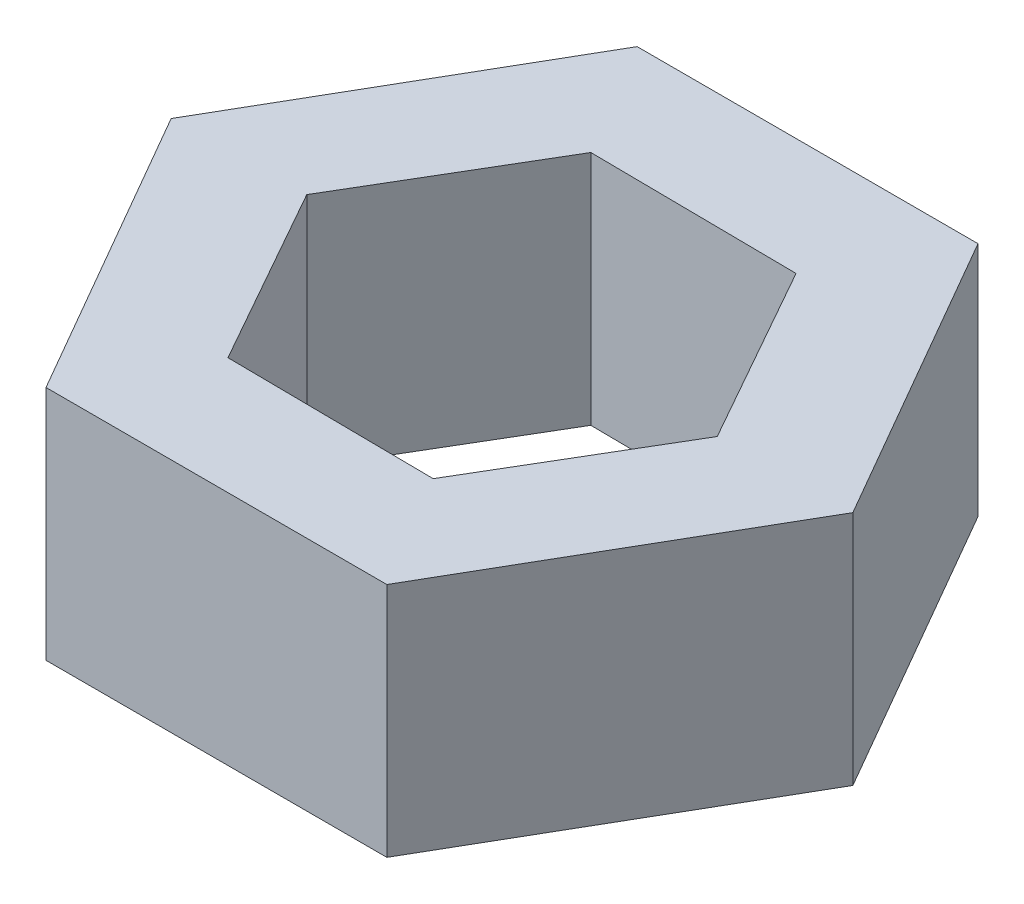
ISO-10303-21;
HEADER;
FILE_DESCRIPTION(('STEP AP214'),'2;1');
FILE_NAME('part.step','',(''),(''),'','','');
FILE_SCHEMA(('AUTOMOTIVE_DESIGN { 1 0 10303 214 1 1 1 1 }'));
ENDSEC;
DATA;
#1=APPLICATION_CONTEXT('core data for automotive mechanical design processes');
#2=APPLICATION_PROTOCOL_DEFINITION('international standard','automotive_design',2000,#1);
#3=PRODUCT_CONTEXT('',#1,'mechanical');
#4=PRODUCT('Part','Part','',(#3));
#5=PRODUCT_RELATED_PRODUCT_CATEGORY('part','',(#4));
#6=PRODUCT_DEFINITION_FORMATION('','',#4);
#7=PRODUCT_DEFINITION_CONTEXT('part definition',#1,'design');
#8=PRODUCT_DEFINITION('design','',#6,#7);
#9=PRODUCT_DEFINITION_SHAPE('','',#8);
#10=(LENGTH_UNIT() NAMED_UNIT(*) SI_UNIT(.MILLI.,.METRE.));
#11=(NAMED_UNIT(*) PLANE_ANGLE_UNIT() SI_UNIT($,.RADIAN.));
#12=(NAMED_UNIT(*) SI_UNIT($,.STERADIAN.) SOLID_ANGLE_UNIT());
#13=UNCERTAINTY_MEASURE_WITH_UNIT(LENGTH_MEASURE(1.E-05),#10,'distance_accuracy_value','');
#14=(GEOMETRIC_REPRESENTATION_CONTEXT(3) GLOBAL_UNCERTAINTY_ASSIGNED_CONTEXT((#13)) GLOBAL_UNIT_ASSIGNED_CONTEXT((#10,
#11,#12)) REPRESENTATION_CONTEXT('',''));
#15=CARTESIAN_POINT('',(0.,0.,0.));
#16=DIRECTION('',(0.,0.,1.));
#17=DIRECTION('',(1.,0.,0.));
#18=AXIS2_PLACEMENT_3D('',#15,#16,#17);
#19=CARTESIAN_POINT('',(0.,5.,0.));
#20=DIRECTION('',(0.,1.,0.));
#21=DIRECTION('',(0.,0.,1.));
#22=AXIS2_PLACEMENT_3D('',#19,#20,#21);
#23=PLANE('',#22);
#24=DIRECTION('',(0.99999978219207,0.,0.000660011979197733));
#25=VECTOR('',#24,1.);
#26=CARTESIAN_POINT('',(-3.61256347135848,5.,6.24761702561382));
#27=LINE('',#26,#25);
#28=CARTESIAN_POINT('',(-3.61256347135848,5.,6.24761702561382));
#29=VERTEX_POINT('',#28);
#30=CARTESIAN_POINT('',(3.60431332161851,5.,6.25238025178705));
#31=VERTEX_POINT('',#30);
#32=EDGE_CURVE('E173',#29,#31,#27,.T.);
#33=ORIENTED_EDGE('',*,*,#32,.T.);
#34=DIRECTION('',(0.500571478236822,0.,-0.865695209167639));
#35=VECTOR('',#34,1.);
#36=CARTESIAN_POINT('',(3.60431332161851,5.,6.25238025178705));
#37=LINE('',#36,#35);
#38=CARTESIAN_POINT('',(7.21687679297698,5.,0.00476322617322478));
#39=VERTEX_POINT('',#38);
#40=EDGE_CURVE('E176',#31,#39,#37,.T.);
#41=ORIENTED_EDGE('',*,*,#40,.T.);
#42=DIRECTION('',(-0.499428303955248,0.,-0.866355221146837));
#43=VECTOR('',#42,1.);
#44=CARTESIAN_POINT('',(7.21687679297698,5.,0.00476322617322478));
#45=LINE('',#44,#43);
#46=CARTESIAN_POINT('',(3.61256347135847,5.,-6.24761702561383));
#47=VERTEX_POINT('',#46);
#48=EDGE_CURVE('E179',#39,#47,#45,.T.);
#49=ORIENTED_EDGE('',*,*,#48,.T.);
#50=DIRECTION('',(-0.99999978219207,0.,-0.000660011979197492));
#51=VECTOR('',#50,1.);
#52=CARTESIAN_POINT('',(3.61256347135847,5.,-6.24761702561383));
#53=LINE('',#52,#51);
#54=CARTESIAN_POINT('',(-3.60431332161851,5.,-6.25238025178705));
#55=VERTEX_POINT('',#54);
#56=EDGE_CURVE('E181',#47,#55,#53,.T.);
#57=ORIENTED_EDGE('',*,*,#56,.T.);
#58=DIRECTION('',(-0.500571478236822,0.,0.865695209167639));
#59=VECTOR('',#58,1.);
#60=CARTESIAN_POINT('',(-3.60431332161851,5.,-6.25238025178705));
#61=LINE('',#60,#59);
#62=CARTESIAN_POINT('',(-7.21687679297698,5.,-0.00476322617322694));
#63=VERTEX_POINT('',#62);
#64=EDGE_CURVE('E183',#55,#63,#61,.T.);
#65=ORIENTED_EDGE('',*,*,#64,.T.);
#66=DIRECTION('',(0.499428303955248,0.,0.866355221146837));
#67=VECTOR('',#66,1.);
#68=CARTESIAN_POINT('',(-7.21687679297698,5.,-0.00476322617322694));
#69=LINE('',#68,#67);
#70=EDGE_CURVE('E185',#63,#29,#69,.T.);
#71=ORIENTED_EDGE('',*,*,#70,.T.);
#72=EDGE_LOOP('',(#33,#41,#49,#57,#65,#71));
#73=FACE_BOUND('',#72,.T.);
#74=DIRECTION('',(0.508933412048692,0.,-0.860805891069802));
#75=VECTOR('',#74,1.);
#76=CARTESIAN_POINT('',(2.1544975847708,5.,3.82249571491586));
#77=LINE('',#76,#75);
#78=CARTESIAN_POINT('',(2.1544975847708,5.,3.82249571491586));
#79=VERTEX_POINT('',#78);
#80=CARTESIAN_POINT('',(4.3876271873597,5.,0.0453982166541963));
#81=VERTEX_POINT('',#80);
#82=EDGE_CURVE('E130',#79,#81,#77,.T.);
#83=ORIENTED_EDGE('',*,*,#82,.F.);
#84=DIRECTION('',(0.999946475418095,0.,0.0103463181339593));
#85=VECTOR('',#84,1.);
#86=CARTESIAN_POINT('',(-2.23312960258889,5.,3.77709749826166));
#87=LINE('',#86,#85);
#88=CARTESIAN_POINT('',(-2.23312960258889,5.,3.77709749826166));
#89=VERTEX_POINT('',#88);
#90=EDGE_CURVE('E122',#89,#79,#87,.T.);
#91=ORIENTED_EDGE('',*,*,#90,.F.);
#92=DIRECTION('',(0.491013063369403,0.,0.871152209203762));
#93=VECTOR('',#92,1.);
#94=CARTESIAN_POINT('',(-4.3876271873597,5.,-0.0453982166541961));
#95=LINE('',#94,#93);
#96=CARTESIAN_POINT('',(-4.3876271873597,5.,-0.0453982166541964));
#97=VERTEX_POINT('',#96);
#98=EDGE_CURVE('E151',#97,#89,#95,.T.);
#99=ORIENTED_EDGE('',*,*,#98,.F.);
#100=DIRECTION('',(-0.508933412048692,0.,0.860805891069802));
#101=VECTOR('',#100,1.);
#102=CARTESIAN_POINT('',(-2.1544975847708,5.,-3.82249571491586));
#103=LINE('',#102,#101);
#104=CARTESIAN_POINT('',(-2.1544975847708,5.,-3.82249571491586));
#105=VERTEX_POINT('',#104);
#106=EDGE_CURVE('E149',#105,#97,#103,.T.);
#107=ORIENTED_EDGE('',*,*,#106,.F.);
#108=DIRECTION('',(-0.999946475418095,0.,-0.0103463181339592));
#109=VECTOR('',#108,1.);
#110=CARTESIAN_POINT('',(2.23312960258889,5.,-3.77709749826166));
#111=LINE('',#110,#109);
#112=CARTESIAN_POINT('',(2.23312960258889,5.,-3.77709749826166));
#113=VERTEX_POINT('',#112);
#114=EDGE_CURVE('E145',#113,#105,#111,.T.);
#115=ORIENTED_EDGE('',*,*,#114,.F.);
#116=DIRECTION('',(-0.491013063369403,0.,-0.871152209203762));
#117=VECTOR('',#116,1.);
#118=CARTESIAN_POINT('',(4.3876271873597,5.,0.0453982166541963));
#119=LINE('',#118,#117);
#120=EDGE_CURVE('E143',#81,#113,#119,.T.);
#121=ORIENTED_EDGE('',*,*,#120,.F.);
#122=EDGE_LOOP('',(#83,#91,#99,#107,#115,#121));
#123=FACE_BOUND('',#122,.T.);
#124=ADVANCED_FACE('F33',(#73,#123),#23,.T.);
#125=CARTESIAN_POINT('',(0.,0.,0.));
#126=DIRECTION('',(0.,1.,0.));
#127=DIRECTION('',(0.,0.,1.));
#128=AXIS2_PLACEMENT_3D('',#125,#126,#127);
#129=PLANE('',#128);
#130=DIRECTION('',(0.99999978219207,0.,0.000660011979197733));
#131=VECTOR('',#130,1.);
#132=CARTESIAN_POINT('',(-3.61256347135848,0.,6.24761702561382));
#133=LINE('',#132,#131);
#134=CARTESIAN_POINT('',(-3.61256347135848,0.,6.24761702561382));
#135=VERTEX_POINT('',#134);
#136=CARTESIAN_POINT('',(3.60431332161851,0.,6.25238025178705));
#137=VERTEX_POINT('',#136);
#138=EDGE_CURVE('E138',#135,#137,#133,.T.);
#139=ORIENTED_EDGE('',*,*,#138,.F.);
#140=DIRECTION('',(0.499428303955248,0.,0.866355221146837));
#141=VECTOR('',#140,1.);
#142=CARTESIAN_POINT('',(-7.21687679297698,0.,-0.00476322617322694));
#143=LINE('',#142,#141);
#144=CARTESIAN_POINT('',(-7.21687679297698,0.,-0.00476322617322694));
#145=VERTEX_POINT('',#144);
#146=EDGE_CURVE('E177',#145,#135,#143,.T.);
#147=ORIENTED_EDGE('',*,*,#146,.F.);
#148=DIRECTION('',(-0.500571478236822,0.,0.865695209167639));
#149=VECTOR('',#148,1.);
#150=CARTESIAN_POINT('',(-3.60431332161851,0.,-6.25238025178705));
#151=LINE('',#150,#149);
#152=CARTESIAN_POINT('',(-3.60431332161851,0.,-6.25238025178705));
#153=VERTEX_POINT('',#152);
#154=EDGE_CURVE('E196',#153,#145,#151,.T.);
#155=ORIENTED_EDGE('',*,*,#154,.F.);
#156=DIRECTION('',(-0.99999978219207,0.,-0.000660011979197492));
#157=VECTOR('',#156,1.);
#158=CARTESIAN_POINT('',(3.61256347135847,0.,-6.24761702561383));
#159=LINE('',#158,#157);
#160=CARTESIAN_POINT('',(3.61256347135847,0.,-6.24761702561383));
#161=VERTEX_POINT('',#160);
#162=EDGE_CURVE('E194',#161,#153,#159,.T.);
#163=ORIENTED_EDGE('',*,*,#162,.F.);
#164=DIRECTION('',(-0.499428303955248,0.,-0.866355221146837));
#165=VECTOR('',#164,1.);
#166=CARTESIAN_POINT('',(7.21687679297698,0.,0.00476322617322478));
#167=LINE('',#166,#165);
#168=CARTESIAN_POINT('',(7.21687679297698,0.,0.00476322617322478));
#169=VERTEX_POINT('',#168);
#170=EDGE_CURVE('E192',#169,#161,#167,.T.);
#171=ORIENTED_EDGE('',*,*,#170,.F.);
#172=DIRECTION('',(0.500571478236822,0.,-0.865695209167639));
#173=VECTOR('',#172,1.);
#174=CARTESIAN_POINT('',(3.60431332161851,0.,6.25238025178705));
#175=LINE('',#174,#173);
#176=EDGE_CURVE('E190',#137,#169,#175,.T.);
#177=ORIENTED_EDGE('',*,*,#176,.F.);
#178=EDGE_LOOP('',(#139,#147,#155,#163,#171,#177));
#179=FACE_BOUND('',#178,.T.);
#180=DIRECTION('',(0.999946475418095,0.,0.0103463181339593));
#181=VECTOR('',#180,1.);
#182=CARTESIAN_POINT('',(-2.23312960258889,0.,3.77709749826166));
#183=LINE('',#182,#181);
#184=CARTESIAN_POINT('',(-2.23312960258889,0.,3.77709749826166));
#185=VERTEX_POINT('',#184);
#186=CARTESIAN_POINT('',(2.1544975847708,0.,3.82249571491586));
#187=VERTEX_POINT('',#186);
#188=EDGE_CURVE('E56',#185,#187,#183,.T.);
#189=ORIENTED_EDGE('',*,*,#188,.T.);
#190=DIRECTION('',(0.508933412048692,0.,-0.860805891069802));
#191=VECTOR('',#190,1.);
#192=CARTESIAN_POINT('',(2.1544975847708,0.,3.82249571491586));
#193=LINE('',#192,#191);
#194=CARTESIAN_POINT('',(4.3876271873597,0.,0.0453982166541963));
#195=VERTEX_POINT('',#194);
#196=EDGE_CURVE('E137',#187,#195,#193,.T.);
#197=ORIENTED_EDGE('',*,*,#196,.T.);
#198=DIRECTION('',(-0.491013063369403,0.,-0.871152209203762));
#199=VECTOR('',#198,1.);
#200=CARTESIAN_POINT('',(4.3876271873597,0.,0.0453982166541963));
#201=LINE('',#200,#199);
#202=CARTESIAN_POINT('',(2.23312960258889,0.,-3.77709749826166));
#203=VERTEX_POINT('',#202);
#204=EDGE_CURVE('E155',#195,#203,#201,.T.);
#205=ORIENTED_EDGE('',*,*,#204,.T.);
#206=DIRECTION('',(-0.999946475418095,0.,-0.0103463181339592));
#207=VECTOR('',#206,1.);
#208=CARTESIAN_POINT('',(2.23312960258889,0.,-3.77709749826166));
#209=LINE('',#208,#207);
#210=CARTESIAN_POINT('',(-2.1544975847708,0.,-3.82249571491586));
#211=VERTEX_POINT('',#210);
#212=EDGE_CURVE('E158',#203,#211,#209,.T.);
#213=ORIENTED_EDGE('',*,*,#212,.T.);
#214=DIRECTION('',(-0.508933412048692,0.,0.860805891069802));
#215=VECTOR('',#214,1.);
#216=CARTESIAN_POINT('',(-2.1544975847708,0.,-3.82249571491586));
#217=LINE('',#216,#215);
#218=CARTESIAN_POINT('',(-4.3876271873597,0.,-0.0453982166541961));
#219=VERTEX_POINT('',#218);
#220=EDGE_CURVE('E161',#211,#219,#217,.T.);
#221=ORIENTED_EDGE('',*,*,#220,.T.);
#222=DIRECTION('',(0.491013063369403,0.,0.871152209203762));
#223=VECTOR('',#222,1.);
#224=CARTESIAN_POINT('',(-4.3876271873597,0.,-0.0453982166541961));
#225=LINE('',#224,#223);
#226=EDGE_CURVE('E131',#219,#185,#225,.T.);
#227=ORIENTED_EDGE('',*,*,#226,.T.);
#228=EDGE_LOOP('',(#189,#197,#205,#213,#221,#227));
#229=FACE_BOUND('',#228,.T.);
#230=ADVANCED_FACE('F220',(#179,#229),#129,.F.);
#231=CARTESIAN_POINT('',(-3.61256347135848,5.,6.24761702561382));
#232=DIRECTION('',(0.000660011979197733,0.,-0.99999978219207));
#233=DIRECTION('',(-0.99999978219207,0.,-0.000660011979197733));
#234=AXIS2_PLACEMENT_3D('',#231,#232,#233);
#235=PLANE('',#234);
#236=ORIENTED_EDGE('',*,*,#138,.T.);
#237=DIRECTION('',(0.,-1.,0.));
#238=VECTOR('',#237,1.);
#239=CARTESIAN_POINT('',(3.60431332161851,5.,6.25238025178705));
#240=LINE('',#239,#238);
#241=EDGE_CURVE('E11',#31,#137,#240,.T.);
#242=ORIENTED_EDGE('',*,*,#241,.F.);
#243=ORIENTED_EDGE('',*,*,#32,.F.);
#244=DIRECTION('',(0.,-1.,0.));
#245=VECTOR('',#244,1.);
#246=CARTESIAN_POINT('',(-3.61256347135848,5.,6.24761702561382));
#247=LINE('',#246,#245);
#248=EDGE_CURVE('E187',#29,#135,#247,.T.);
#249=ORIENTED_EDGE('',*,*,#248,.T.);
#250=EDGE_LOOP('',(#236,#242,#243,#249));
#251=FACE_BOUND('',#250,.T.);
#252=ADVANCED_FACE('F35',(#251),#235,.F.);
#253=CARTESIAN_POINT('',(3.60431332161851,5.,6.25238025178705));
#254=DIRECTION('',(-0.865695209167639,0.,-0.500571478236822));
#255=DIRECTION('',(-0.500571478236822,0.,0.865695209167639));
#256=AXIS2_PLACEMENT_3D('',#253,#254,#255);
#257=PLANE('',#256);
#258=ORIENTED_EDGE('',*,*,#176,.T.);
#259=DIRECTION('',(0.,-1.,0.));
#260=VECTOR('',#259,1.);
#261=CARTESIAN_POINT('',(7.21687679297698,5.,0.00476322617322478));
#262=LINE('',#261,#260);
#263=EDGE_CURVE('E41',#39,#169,#262,.T.);
#264=ORIENTED_EDGE('',*,*,#263,.F.);
#265=ORIENTED_EDGE('',*,*,#40,.F.);
#266=ORIENTED_EDGE('',*,*,#241,.T.);
#267=EDGE_LOOP('',(#258,#264,#265,#266));
#268=FACE_BOUND('',#267,.T.);
#269=ADVANCED_FACE('F237',(#268),#257,.F.);
#270=CARTESIAN_POINT('',(7.21687679297698,5.,0.00476322617322478));
#271=DIRECTION('',(-0.866355221146837,0.,0.499428303955248));
#272=DIRECTION('',(0.499428303955248,0.,0.866355221146837));
#273=AXIS2_PLACEMENT_3D('',#270,#271,#272);
#274=PLANE('',#273);
#275=ORIENTED_EDGE('',*,*,#170,.T.);
#276=DIRECTION('',(0.,-1.,0.));
#277=VECTOR('',#276,1.);
#278=CARTESIAN_POINT('',(3.61256347135847,5.,-6.24761702561383));
#279=LINE('',#278,#277);
#280=EDGE_CURVE('E207',#47,#161,#279,.T.);
#281=ORIENTED_EDGE('',*,*,#280,.F.);
#282=ORIENTED_EDGE('',*,*,#48,.F.);
#283=ORIENTED_EDGE('',*,*,#263,.T.);
#284=EDGE_LOOP('',(#275,#281,#282,#283));
#285=FACE_BOUND('',#284,.T.);
#286=ADVANCED_FACE('F214',(#285),#274,.F.);
#287=CARTESIAN_POINT('',(3.61256347135847,5.,-6.24761702561383));
#288=DIRECTION('',(-0.000660011979197492,0.,0.99999978219207));
#289=DIRECTION('',(0.99999978219207,0.,0.000660011979197492));
#290=AXIS2_PLACEMENT_3D('',#287,#288,#289);
#291=PLANE('',#290);
#292=ORIENTED_EDGE('',*,*,#162,.T.);
#293=DIRECTION('',(0.,-1.,0.));
#294=VECTOR('',#293,1.);
#295=CARTESIAN_POINT('',(-3.60431332161851,5.,-6.25238025178705));
#296=LINE('',#295,#294);
#297=EDGE_CURVE('E204',#55,#153,#296,.T.);
#298=ORIENTED_EDGE('',*,*,#297,.F.);
#299=ORIENTED_EDGE('',*,*,#56,.F.);
#300=ORIENTED_EDGE('',*,*,#280,.T.);
#301=EDGE_LOOP('',(#292,#298,#299,#300));
#302=FACE_BOUND('',#301,.T.);
#303=ADVANCED_FACE('F226',(#302),#291,.F.);
#304=CARTESIAN_POINT('',(-3.60431332161851,5.,-6.25238025178705));
#305=DIRECTION('',(0.865695209167639,0.,0.500571478236822));
#306=DIRECTION('',(0.500571478236822,0.,-0.865695209167639));
#307=AXIS2_PLACEMENT_3D('',#304,#305,#306);
#308=PLANE('',#307);
#309=ORIENTED_EDGE('',*,*,#154,.T.);
#310=DIRECTION('',(0.,-1.,0.));
#311=VECTOR('',#310,1.);
#312=CARTESIAN_POINT('',(-7.21687679297698,5.,-0.00476322617322694));
#313=LINE('',#312,#311);
#314=EDGE_CURVE('E201',#63,#145,#313,.T.);
#315=ORIENTED_EDGE('',*,*,#314,.F.);
#316=ORIENTED_EDGE('',*,*,#64,.F.);
#317=ORIENTED_EDGE('',*,*,#297,.T.);
#318=EDGE_LOOP('',(#309,#315,#316,#317));
#319=FACE_BOUND('',#318,.T.);
#320=ADVANCED_FACE('F230',(#319),#308,.F.);
#321=CARTESIAN_POINT('',(-7.21687679297698,5.,-0.00476322617322694));
#322=DIRECTION('',(0.866355221146837,0.,-0.499428303955248));
#323=DIRECTION('',(-0.499428303955248,0.,-0.866355221146837));
#324=AXIS2_PLACEMENT_3D('',#321,#322,#323);
#325=PLANE('',#324);
#326=ORIENTED_EDGE('',*,*,#146,.T.);
#327=ORIENTED_EDGE('',*,*,#248,.F.);
#328=ORIENTED_EDGE('',*,*,#70,.F.);
#329=ORIENTED_EDGE('',*,*,#314,.T.);
#330=EDGE_LOOP('',(#326,#327,#328,#329));
#331=FACE_BOUND('',#330,.T.);
#332=ADVANCED_FACE('F240',(#331),#325,.F.);
#333=CARTESIAN_POINT('',(-2.23312960258889,5.,3.77709749826166));
#334=DIRECTION('',(0.0103463181339593,0.,-0.999946475418095));
#335=DIRECTION('',(-0.999946475418095,0.,-0.0103463181339593));
#336=AXIS2_PLACEMENT_3D('',#333,#334,#335);
#337=PLANE('',#336);
#338=ORIENTED_EDGE('',*,*,#188,.F.);
#339=DIRECTION('',(0.,-1.,0.));
#340=VECTOR('',#339,1.);
#341=CARTESIAN_POINT('',(-2.23312960258889,5.,3.77709749826166));
#342=LINE('',#341,#340);
#343=EDGE_CURVE('E126',#89,#185,#342,.T.);
#344=ORIENTED_EDGE('',*,*,#343,.F.);
#345=ORIENTED_EDGE('',*,*,#90,.T.);
#346=DIRECTION('',(0.,-1.,0.));
#347=VECTOR('',#346,1.);
#348=CARTESIAN_POINT('',(2.1544975847708,5.,3.82249571491586));
#349=LINE('',#348,#347);
#350=EDGE_CURVE('E125',#79,#187,#349,.T.);
#351=ORIENTED_EDGE('',*,*,#350,.T.);
#352=EDGE_LOOP('',(#338,#344,#345,#351));
#353=FACE_BOUND('',#352,.T.);
#354=ADVANCED_FACE('F124',(#353),#337,.T.);
#355=CARTESIAN_POINT('',(2.1544975847708,5.,3.82249571491586));
#356=DIRECTION('',(-0.860805891069802,0.,-0.508933412048692));
#357=DIRECTION('',(-0.508933412048692,0.,0.860805891069802));
#358=AXIS2_PLACEMENT_3D('',#355,#356,#357);
#359=PLANE('',#358);
#360=ORIENTED_EDGE('',*,*,#196,.F.);
#361=ORIENTED_EDGE('',*,*,#350,.F.);
#362=ORIENTED_EDGE('',*,*,#82,.T.);
#363=DIRECTION('',(0.,-1.,0.));
#364=VECTOR('',#363,1.);
#365=CARTESIAN_POINT('',(4.3876271873597,5.,0.0453982166541963));
#366=LINE('',#365,#364);
#367=EDGE_CURVE('E139',#81,#195,#366,.T.);
#368=ORIENTED_EDGE('',*,*,#367,.T.);
#369=EDGE_LOOP('',(#360,#361,#362,#368));
#370=FACE_BOUND('',#369,.T.);
#371=ADVANCED_FACE('F134',(#370),#359,.T.);
#372=CARTESIAN_POINT('',(4.3876271873597,5.,0.0453982166541963));
#373=DIRECTION('',(-0.871152209203762,0.,0.491013063369403));
#374=DIRECTION('',(0.491013063369403,0.,0.871152209203762));
#375=AXIS2_PLACEMENT_3D('',#372,#373,#374);
#376=PLANE('',#375);
#377=ORIENTED_EDGE('',*,*,#204,.F.);
#378=ORIENTED_EDGE('',*,*,#367,.F.);
#379=ORIENTED_EDGE('',*,*,#120,.T.);
#380=DIRECTION('',(0.,-1.,0.));
#381=VECTOR('',#380,1.);
#382=CARTESIAN_POINT('',(2.23312960258889,5.,-3.77709749826166));
#383=LINE('',#382,#381);
#384=EDGE_CURVE('E170',#113,#203,#383,.T.);
#385=ORIENTED_EDGE('',*,*,#384,.T.);
#386=EDGE_LOOP('',(#377,#378,#379,#385));
#387=FACE_BOUND('',#386,.T.);
#388=ADVANCED_FACE('F258',(#387),#376,.T.);
#389=CARTESIAN_POINT('',(2.23312960258889,5.,-3.77709749826166));
#390=DIRECTION('',(-0.0103463181339592,0.,0.999946475418095));
#391=DIRECTION('',(0.999946475418095,0.,0.0103463181339592));
#392=AXIS2_PLACEMENT_3D('',#389,#390,#391);
#393=PLANE('',#392);
#394=ORIENTED_EDGE('',*,*,#212,.F.);
#395=ORIENTED_EDGE('',*,*,#384,.F.);
#396=ORIENTED_EDGE('',*,*,#114,.T.);
#397=DIRECTION('',(0.,-1.,0.));
#398=VECTOR('',#397,1.);
#399=CARTESIAN_POINT('',(-2.1544975847708,5.,-3.82249571491586));
#400=LINE('',#399,#398);
#401=EDGE_CURVE('E168',#105,#211,#400,.T.);
#402=ORIENTED_EDGE('',*,*,#401,.T.);
#403=EDGE_LOOP('',(#394,#395,#396,#402));
#404=FACE_BOUND('',#403,.T.);
#405=ADVANCED_FACE('F261',(#404),#393,.T.);
#406=CARTESIAN_POINT('',(-2.1544975847708,5.,-3.82249571491586));
#407=DIRECTION('',(0.860805891069802,0.,0.508933412048692));
#408=DIRECTION('',(0.508933412048692,0.,-0.860805891069802));
#409=AXIS2_PLACEMENT_3D('',#406,#407,#408);
#410=PLANE('',#409);
#411=ORIENTED_EDGE('',*,*,#220,.F.);
#412=ORIENTED_EDGE('',*,*,#401,.F.);
#413=ORIENTED_EDGE('',*,*,#106,.T.);
#414=DIRECTION('',(0.,-1.,0.));
#415=VECTOR('',#414,1.);
#416=CARTESIAN_POINT('',(-4.3876271873597,5.,-0.0453982166541961));
#417=LINE('',#416,#415);
#418=EDGE_CURVE('E48',#97,#219,#417,.T.);
#419=ORIENTED_EDGE('',*,*,#418,.T.);
#420=EDGE_LOOP('',(#411,#412,#413,#419));
#421=FACE_BOUND('',#420,.T.);
#422=ADVANCED_FACE('F265',(#421),#410,.T.);
#423=CARTESIAN_POINT('',(-4.3876271873597,5.,-0.0453982166541961));
#424=DIRECTION('',(0.871152209203762,0.,-0.491013063369403));
#425=DIRECTION('',(-0.491013063369403,0.,-0.871152209203762));
#426=AXIS2_PLACEMENT_3D('',#423,#424,#425);
#427=PLANE('',#426);
#428=ORIENTED_EDGE('',*,*,#226,.F.);
#429=ORIENTED_EDGE('',*,*,#418,.F.);
#430=ORIENTED_EDGE('',*,*,#98,.T.);
#431=ORIENTED_EDGE('',*,*,#343,.T.);
#432=EDGE_LOOP('',(#428,#429,#430,#431));
#433=FACE_BOUND('',#432,.T.);
#434=ADVANCED_FACE('F269',(#433),#427,.T.);
#435=CLOSED_SHELL('',(#124,#230,#252,#269,#286,#303,#320,#332,#354,#371,#388,#405,#422,#434));
#436=MANIFOLD_SOLID_BREP('B2',#435);
#437=ADVANCED_BREP_SHAPE_REPRESENTATION('',(#18,#436),#14);
#438=SHAPE_DEFINITION_REPRESENTATION(#9,#437);
ENDSEC;
END-ISO-10303-21;
